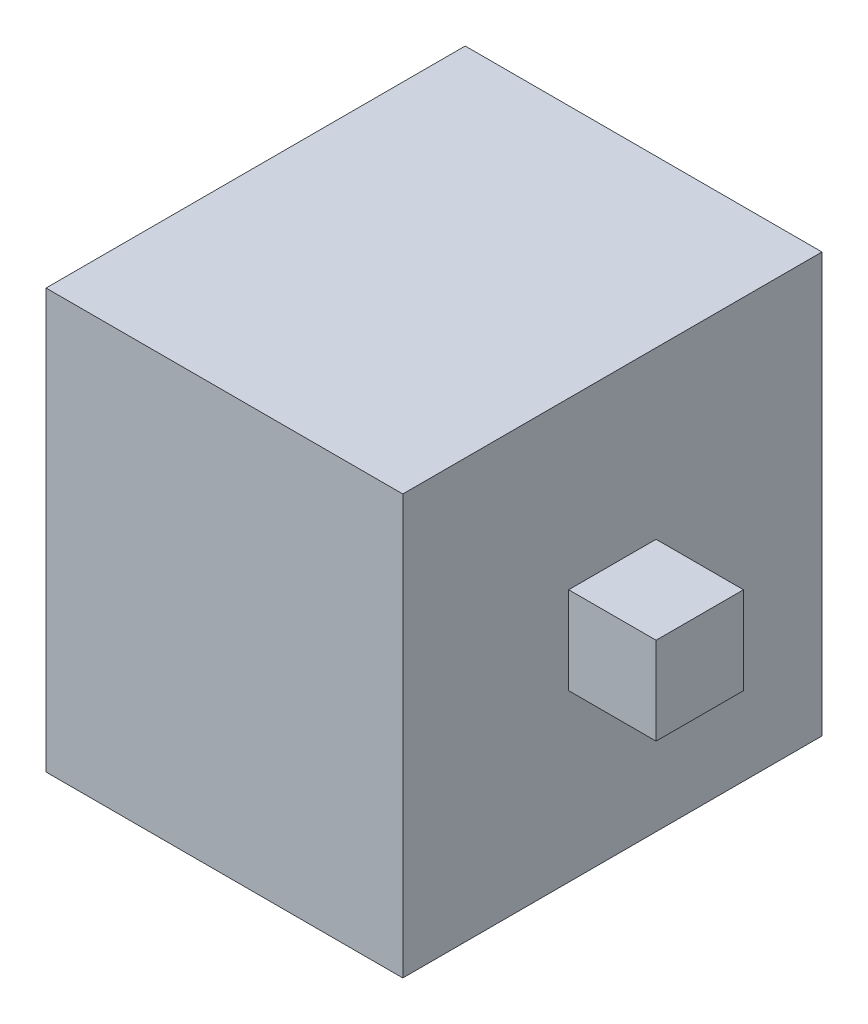
ISO-10303-21;
HEADER;
FILE_DESCRIPTION(('STEP AP214'),'2;1');
FILE_NAME('part.step','',(''),(''),'','','');
FILE_SCHEMA(('AUTOMOTIVE_DESIGN { 1 0 10303 214 1 1 1 1 }'));
ENDSEC;
DATA;
#1=APPLICATION_CONTEXT('core data for automotive mechanical design processes');
#2=APPLICATION_PROTOCOL_DEFINITION('international standard','automotive_design',2000,#1);
#3=PRODUCT_CONTEXT('',#1,'mechanical');
#4=PRODUCT('Part','Part','',(#3));
#5=PRODUCT_RELATED_PRODUCT_CATEGORY('part','',(#4));
#6=PRODUCT_DEFINITION_FORMATION('','',#4);
#7=PRODUCT_DEFINITION_CONTEXT('part definition',#1,'design');
#8=PRODUCT_DEFINITION('design','',#6,#7);
#9=PRODUCT_DEFINITION_SHAPE('','',#8);
#10=(LENGTH_UNIT() NAMED_UNIT(*) SI_UNIT(.MILLI.,.METRE.));
#11=(NAMED_UNIT(*) PLANE_ANGLE_UNIT() SI_UNIT($,.RADIAN.));
#12=(NAMED_UNIT(*) SI_UNIT($,.STERADIAN.) SOLID_ANGLE_UNIT());
#13=UNCERTAINTY_MEASURE_WITH_UNIT(LENGTH_MEASURE(1.E-05),#10,'distance_accuracy_value','');
#14=(GEOMETRIC_REPRESENTATION_CONTEXT(3) GLOBAL_UNCERTAINTY_ASSIGNED_CONTEXT((#13)) GLOBAL_UNIT_ASSIGNED_CONTEXT((#10,
#11,#12)) REPRESENTATION_CONTEXT('',''));
#15=CARTESIAN_POINT('',(0.,0.,0.));
#16=DIRECTION('',(0.,0.,1.));
#17=DIRECTION('',(1.,0.,0.));
#18=AXIS2_PLACEMENT_3D('',#15,#16,#17);
#19=CARTESIAN_POINT('',(99.9999999999999,117.5,235.));
#20=DIRECTION('',(-1.,0.,0.));
#21=DIRECTION('',(0.,-1.,0.));
#22=AXIS2_PLACEMENT_3D('',#19,#20,#21);
#23=PLANE('',#22);
#24=DIRECTION('',(0.,1.,0.));
#25=VECTOR('',#24,1.);
#26=CARTESIAN_POINT('',(99.9999999999999,117.5,0.));
#27=LINE('',#26,#25);
#28=CARTESIAN_POINT('',(100.,-117.5,0.));
#29=VERTEX_POINT('',#28);
#30=CARTESIAN_POINT('',(99.9999999999999,117.5,0.));
#31=VERTEX_POINT('',#30);
#32=EDGE_CURVE('E160',#29,#31,#27,.T.);
#33=ORIENTED_EDGE('',*,*,#32,.T.);
#34=DIRECTION('',(0.,0.,-1.));
#35=VECTOR('',#34,1.);
#36=CARTESIAN_POINT('',(99.9999999999999,117.5,235.));
#37=LINE('',#36,#35);
#38=CARTESIAN_POINT('',(99.9999999999999,117.5,235.));
#39=VERTEX_POINT('',#38);
#40=EDGE_CURVE('E168',#39,#31,#37,.T.);
#41=ORIENTED_EDGE('',*,*,#40,.F.);
#42=DIRECTION('',(0.,1.,0.));
#43=VECTOR('',#42,1.);
#44=CARTESIAN_POINT('',(99.9999999999999,117.5,235.));
#45=LINE('',#44,#43);
#46=CARTESIAN_POINT('',(100.,-117.5,235.));
#47=VERTEX_POINT('',#46);
#48=EDGE_CURVE('E151',#47,#39,#45,.T.);
#49=ORIENTED_EDGE('',*,*,#48,.F.);
#50=DIRECTION('',(0.,0.,-1.));
#51=VECTOR('',#50,1.);
#52=CARTESIAN_POINT('',(100.,-117.5,235.));
#53=LINE('',#52,#51);
#54=EDGE_CURVE('E52',#47,#29,#53,.T.);
#55=ORIENTED_EDGE('',*,*,#54,.T.);
#56=EDGE_LOOP('',(#33,#41,#49,#55));
#57=FACE_BOUND('',#56,.T.);
#58=DIRECTION('',(0.,-1.,0.));
#59=VECTOR('',#58,1.);
#60=CARTESIAN_POINT('',(100.,24.5,142.));
#61=LINE('',#60,#59);
#62=CARTESIAN_POINT('',(100.,24.5,142.));
#63=VERTEX_POINT('',#62);
#64=CARTESIAN_POINT('',(100.,-24.5,142.));
#65=VERTEX_POINT('',#64);
#66=EDGE_CURVE('E59',#63,#65,#61,.T.);
#67=ORIENTED_EDGE('',*,*,#66,.F.);
#68=DIRECTION('',(0.,0.,1.));
#69=VECTOR('',#68,1.);
#70=CARTESIAN_POINT('',(100.,24.5,93.));
#71=LINE('',#70,#69);
#72=CARTESIAN_POINT('',(100.,24.5,93.));
#73=VERTEX_POINT('',#72);
#74=EDGE_CURVE('E63',#73,#63,#71,.T.);
#75=ORIENTED_EDGE('',*,*,#74,.F.);
#76=DIRECTION('',(0.,1.,0.));
#77=VECTOR('',#76,1.);
#78=CARTESIAN_POINT('',(100.,24.5,93.));
#79=LINE('',#78,#77);
#80=CARTESIAN_POINT('',(100.,-24.5,93.));
#81=VERTEX_POINT('',#80);
#82=EDGE_CURVE('E309',#81,#73,#79,.T.);
#83=ORIENTED_EDGE('',*,*,#82,.F.);
#84=DIRECTION('',(0.,0.,-1.));
#85=VECTOR('',#84,1.);
#86=CARTESIAN_POINT('',(100.,-24.5,93.));
#87=LINE('',#86,#85);
#88=EDGE_CURVE('E319',#65,#81,#87,.T.);
#89=ORIENTED_EDGE('',*,*,#88,.F.);
#90=EDGE_LOOP('',(#67,#75,#83,#89));
#91=FACE_BOUND('',#90,.T.);
#92=ADVANCED_FACE('F43',(#57,#91),#23,.F.);
#93=CARTESIAN_POINT('',(-100.,117.5,235.));
#94=DIRECTION('',(1.,0.,0.));
#95=DIRECTION('',(0.,1.,0.));
#96=AXIS2_PLACEMENT_3D('',#93,#94,#95);
#97=PLANE('',#96);
#98=DIRECTION('',(0.,-1.,0.));
#99=VECTOR('',#98,1.);
#100=CARTESIAN_POINT('',(-100.,117.5,0.));
#101=LINE('',#100,#99);
#102=CARTESIAN_POINT('',(-100.,117.5,0.));
#103=VERTEX_POINT('',#102);
#104=CARTESIAN_POINT('',(-100.,-117.5,0.));
#105=VERTEX_POINT('',#104);
#106=EDGE_CURVE('E132',#103,#105,#101,.T.);
#107=ORIENTED_EDGE('',*,*,#106,.T.);
#108=DIRECTION('',(0.,0.,-1.));
#109=VECTOR('',#108,1.);
#110=CARTESIAN_POINT('',(-100.,-117.5,235.));
#111=LINE('',#110,#109);
#112=CARTESIAN_POINT('',(-100.,-117.5,235.));
#113=VERTEX_POINT('',#112);
#114=EDGE_CURVE('E11',#113,#105,#111,.T.);
#115=ORIENTED_EDGE('',*,*,#114,.F.);
#116=DIRECTION('',(0.,-1.,0.));
#117=VECTOR('',#116,1.);
#118=CARTESIAN_POINT('',(-100.,117.5,235.));
#119=LINE('',#118,#117);
#120=CARTESIAN_POINT('',(-100.,117.5,235.));
#121=VERTEX_POINT('',#120);
#122=EDGE_CURVE('E143',#121,#113,#119,.T.);
#123=ORIENTED_EDGE('',*,*,#122,.F.);
#124=DIRECTION('',(0.,0.,-1.));
#125=VECTOR('',#124,1.);
#126=CARTESIAN_POINT('',(-100.,117.5,235.));
#127=LINE('',#126,#125);
#128=EDGE_CURVE('E156',#121,#103,#127,.T.);
#129=ORIENTED_EDGE('',*,*,#128,.T.);
#130=EDGE_LOOP('',(#107,#115,#123,#129));
#131=FACE_BOUND('',#130,.T.);
#132=ADVANCED_FACE('F45',(#131),#97,.F.);
#133=CARTESIAN_POINT('',(100.,-117.5,235.));
#134=DIRECTION('',(0.,1.,0.));
#135=DIRECTION('',(-1.,0.,0.));
#136=AXIS2_PLACEMENT_3D('',#133,#134,#135);
#137=PLANE('',#136);
#138=DIRECTION('',(1.,0.,0.));
#139=VECTOR('',#138,1.);
#140=CARTESIAN_POINT('',(100.,-117.5,0.));
#141=LINE('',#140,#139);
#142=EDGE_CURVE('E137',#105,#29,#141,.T.);
#143=ORIENTED_EDGE('',*,*,#142,.T.);
#144=ORIENTED_EDGE('',*,*,#54,.F.);
#145=DIRECTION('',(1.,0.,0.));
#146=VECTOR('',#145,1.);
#147=CARTESIAN_POINT('',(100.,-117.5,235.));
#148=LINE('',#147,#146);
#149=EDGE_CURVE('E147',#113,#47,#148,.T.);
#150=ORIENTED_EDGE('',*,*,#149,.F.);
#151=ORIENTED_EDGE('',*,*,#114,.T.);
#152=EDGE_LOOP('',(#143,#144,#150,#151));
#153=FACE_BOUND('',#152,.T.);
#154=ADVANCED_FACE('F192',(#153),#137,.F.);
#155=CARTESIAN_POINT('',(99.9999999999999,117.5,235.));
#156=DIRECTION('',(0.,-1.,0.));
#157=DIRECTION('',(1.,0.,0.));
#158=AXIS2_PLACEMENT_3D('',#155,#156,#157);
#159=PLANE('',#158);
#160=DIRECTION('',(-1.,0.,0.));
#161=VECTOR('',#160,1.);
#162=CARTESIAN_POINT('',(99.9999999999999,117.5,0.));
#163=LINE('',#162,#161);
#164=EDGE_CURVE('E148',#31,#103,#163,.T.);
#165=ORIENTED_EDGE('',*,*,#164,.T.);
#166=ORIENTED_EDGE('',*,*,#128,.F.);
#167=DIRECTION('',(-1.,0.,0.));
#168=VECTOR('',#167,1.);
#169=CARTESIAN_POINT('',(99.9999999999999,117.5,235.));
#170=LINE('',#169,#168);
#171=EDGE_CURVE('E154',#39,#121,#170,.T.);
#172=ORIENTED_EDGE('',*,*,#171,.F.);
#173=ORIENTED_EDGE('',*,*,#40,.T.);
#174=EDGE_LOOP('',(#165,#166,#172,#173));
#175=FACE_BOUND('',#174,.T.);
#176=ADVANCED_FACE('F185',(#175),#159,.F.);
#177=CARTESIAN_POINT('',(0.,0.,235.));
#178=DIRECTION('',(0.,0.,-1.));
#179=DIRECTION('',(-1.,0.,0.));
#180=AXIS2_PLACEMENT_3D('',#177,#178,#179);
#181=PLANE('',#180);
#182=ORIENTED_EDGE('',*,*,#122,.T.);
#183=ORIENTED_EDGE('',*,*,#149,.T.);
#184=ORIENTED_EDGE('',*,*,#48,.T.);
#185=ORIENTED_EDGE('',*,*,#171,.T.);
#186=EDGE_LOOP('',(#182,#183,#184,#185));
#187=FACE_BOUND('',#186,.T.);
#188=ADVANCED_FACE('F191',(#187),#181,.F.);
#189=CARTESIAN_POINT('',(0.,0.,0.));
#190=DIRECTION('',(0.,0.,-1.));
#191=DIRECTION('',(-1.,0.,0.));
#192=AXIS2_PLACEMENT_3D('',#189,#190,#191);
#193=PLANE('',#192);
#194=ORIENTED_EDGE('',*,*,#106,.F.);
#195=ORIENTED_EDGE('',*,*,#164,.F.);
#196=ORIENTED_EDGE('',*,*,#32,.F.);
#197=ORIENTED_EDGE('',*,*,#142,.F.);
#198=EDGE_LOOP('',(#194,#195,#196,#197));
#199=FACE_BOUND('',#198,.T.);
#200=ADVANCED_FACE('F182',(#199),#193,.T.);
#201=CARTESIAN_POINT('',(149.,24.5,142.));
#202=DIRECTION('',(0.,0.,-1.));
#203=DIRECTION('',(-1.,0.,0.));
#204=AXIS2_PLACEMENT_3D('',#201,#202,#203);
#205=PLANE('',#204);
#206=ORIENTED_EDGE('',*,*,#66,.T.);
#207=DIRECTION('',(-1.,0.,0.));
#208=VECTOR('',#207,1.);
#209=CARTESIAN_POINT('',(149.,-24.5,142.));
#210=LINE('',#209,#208);
#211=CARTESIAN_POINT('',(149.,-24.5,142.));
#212=VERTEX_POINT('',#211);
#213=EDGE_CURVE('E112',#212,#65,#210,.T.);
#214=ORIENTED_EDGE('',*,*,#213,.F.);
#215=DIRECTION('',(0.,-1.,0.));
#216=VECTOR('',#215,1.);
#217=CARTESIAN_POINT('',(149.,24.5,142.));
#218=LINE('',#217,#216);
#219=CARTESIAN_POINT('',(149.,24.5,142.));
#220=VERTEX_POINT('',#219);
#221=EDGE_CURVE('E119',#220,#212,#218,.T.);
#222=ORIENTED_EDGE('',*,*,#221,.F.);
#223=DIRECTION('',(-1.,0.,0.));
#224=VECTOR('',#223,1.);
#225=CARTESIAN_POINT('',(149.,24.5,142.));
#226=LINE('',#225,#224);
#227=EDGE_CURVE('E306',#220,#63,#226,.T.);
#228=ORIENTED_EDGE('',*,*,#227,.T.);
#229=EDGE_LOOP('',(#206,#214,#222,#228));
#230=FACE_BOUND('',#229,.T.);
#231=ADVANCED_FACE('F130',(#230),#205,.F.);
#232=CARTESIAN_POINT('',(149.,-24.5,93.));
#233=DIRECTION('',(0.,1.,0.));
#234=DIRECTION('',(-1.,0.,0.));
#235=AXIS2_PLACEMENT_3D('',#232,#233,#234);
#236=PLANE('',#235);
#237=ORIENTED_EDGE('',*,*,#88,.T.);
#238=DIRECTION('',(-1.,0.,0.));
#239=VECTOR('',#238,1.);
#240=CARTESIAN_POINT('',(149.,-24.5,93.));
#241=LINE('',#240,#239);
#242=CARTESIAN_POINT('',(149.,-24.5,93.));
#243=VERTEX_POINT('',#242);
#244=EDGE_CURVE('E114',#243,#81,#241,.T.);
#245=ORIENTED_EDGE('',*,*,#244,.F.);
#246=DIRECTION('',(0.,0.,-1.));
#247=VECTOR('',#246,1.);
#248=CARTESIAN_POINT('',(149.,-24.5,93.));
#249=LINE('',#248,#247);
#250=EDGE_CURVE('E107',#212,#243,#249,.T.);
#251=ORIENTED_EDGE('',*,*,#250,.F.);
#252=ORIENTED_EDGE('',*,*,#213,.T.);
#253=EDGE_LOOP('',(#237,#245,#251,#252));
#254=FACE_BOUND('',#253,.T.);
#255=ADVANCED_FACE('F110',(#254),#236,.F.);
#256=CARTESIAN_POINT('',(149.,24.5,93.));
#257=DIRECTION('',(0.,0.,1.));
#258=DIRECTION('',(1.,0.,0.));
#259=AXIS2_PLACEMENT_3D('',#256,#257,#258);
#260=PLANE('',#259);
#261=ORIENTED_EDGE('',*,*,#82,.T.);
#262=DIRECTION('',(-1.,0.,0.));
#263=VECTOR('',#262,1.);
#264=CARTESIAN_POINT('',(149.,24.5,93.));
#265=LINE('',#264,#263);
#266=CARTESIAN_POINT('',(149.,24.5,93.));
#267=VERTEX_POINT('',#266);
#268=EDGE_CURVE('E139',#267,#73,#265,.T.);
#269=ORIENTED_EDGE('',*,*,#268,.F.);
#270=DIRECTION('',(0.,1.,0.));
#271=VECTOR('',#270,1.);
#272=CARTESIAN_POINT('',(149.,24.5,93.));
#273=LINE('',#272,#271);
#274=EDGE_CURVE('E118',#243,#267,#273,.T.);
#275=ORIENTED_EDGE('',*,*,#274,.F.);
#276=ORIENTED_EDGE('',*,*,#244,.T.);
#277=EDGE_LOOP('',(#261,#269,#275,#276));
#278=FACE_BOUND('',#277,.T.);
#279=ADVANCED_FACE('F212',(#278),#260,.F.);
#280=CARTESIAN_POINT('',(149.,24.5,93.));
#281=DIRECTION('',(0.,-1.,0.));
#282=DIRECTION('',(0.,0.,-1.));
#283=AXIS2_PLACEMENT_3D('',#280,#281,#282);
#284=PLANE('',#283);
#285=ORIENTED_EDGE('',*,*,#74,.T.);
#286=ORIENTED_EDGE('',*,*,#227,.F.);
#287=DIRECTION('',(0.,0.,1.));
#288=VECTOR('',#287,1.);
#289=CARTESIAN_POINT('',(149.,24.5,93.));
#290=LINE('',#289,#288);
#291=EDGE_CURVE('E124',#267,#220,#290,.T.);
#292=ORIENTED_EDGE('',*,*,#291,.F.);
#293=ORIENTED_EDGE('',*,*,#268,.T.);
#294=EDGE_LOOP('',(#285,#286,#292,#293));
#295=FACE_BOUND('',#294,.T.);
#296=ADVANCED_FACE('F215',(#295),#284,.F.);
#297=CARTESIAN_POINT('',(149.,0.,0.));
#298=DIRECTION('',(-1.,0.,0.));
#299=DIRECTION('',(0.,0.,1.));
#300=AXIS2_PLACEMENT_3D('',#297,#298,#299);
#301=PLANE('',#300);
#302=ORIENTED_EDGE('',*,*,#221,.T.);
#303=ORIENTED_EDGE('',*,*,#250,.T.);
#304=ORIENTED_EDGE('',*,*,#274,.T.);
#305=ORIENTED_EDGE('',*,*,#291,.T.);
#306=EDGE_LOOP('',(#302,#303,#304,#305));
#307=FACE_BOUND('',#306,.T.);
#308=ADVANCED_FACE('F122',(#307),#301,.F.);
#309=CLOSED_SHELL('',(#92,#132,#154,#176,#188,#200,#231,#255,#279,#296,#308));
#310=MANIFOLD_SOLID_BREP('B2',#309);
#311=ADVANCED_BREP_SHAPE_REPRESENTATION('',(#18,#310),#14);
#312=SHAPE_DEFINITION_REPRESENTATION(#9,#311);
ENDSEC;
END-ISO-10303-21;
